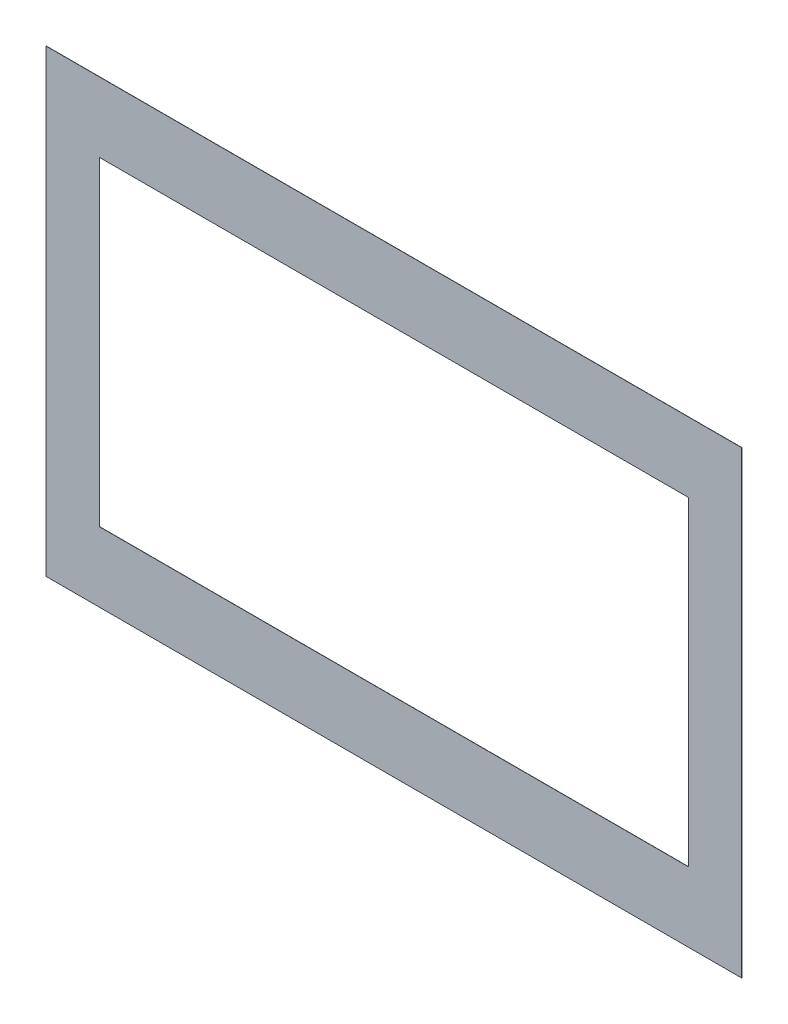
ISO-10303-21;
HEADER;
FILE_DESCRIPTION(('STEP AP214'),'2;1');
FILE_NAME('part.step','',(''),(''),'','','');
FILE_SCHEMA(('AUTOMOTIVE_DESIGN { 1 0 10303 214 1 1 1 1 }'));
ENDSEC;
DATA;
#1=APPLICATION_CONTEXT('core data for automotive mechanical design processes');
#2=APPLICATION_PROTOCOL_DEFINITION('international standard','automotive_design',2000,#1);
#3=PRODUCT_CONTEXT('',#1,'mechanical');
#4=PRODUCT('Part','Part','',(#3));
#5=PRODUCT_RELATED_PRODUCT_CATEGORY('part','',(#4));
#6=PRODUCT_DEFINITION_FORMATION('','',#4);
#7=PRODUCT_DEFINITION_CONTEXT('part definition',#1,'design');
#8=PRODUCT_DEFINITION('design','',#6,#7);
#9=PRODUCT_DEFINITION_SHAPE('','',#8);
#10=(LENGTH_UNIT() NAMED_UNIT(*) SI_UNIT(.MILLI.,.METRE.));
#11=(NAMED_UNIT(*) PLANE_ANGLE_UNIT() SI_UNIT($,.RADIAN.));
#12=(NAMED_UNIT(*) SI_UNIT($,.STERADIAN.) SOLID_ANGLE_UNIT());
#13=UNCERTAINTY_MEASURE_WITH_UNIT(LENGTH_MEASURE(1.E-05),#10,'distance_accuracy_value','');
#14=(GEOMETRIC_REPRESENTATION_CONTEXT(3) GLOBAL_UNCERTAINTY_ASSIGNED_CONTEXT((#13)) GLOBAL_UNIT_ASSIGNED_CONTEXT((#10,
#11,#12)) REPRESENTATION_CONTEXT('',''));
#15=CARTESIAN_POINT('',(0.,0.,0.));
#16=DIRECTION('',(0.,0.,1.));
#17=DIRECTION('',(1.,0.,0.));
#18=AXIS2_PLACEMENT_3D('',#15,#16,#17);
#19=CARTESIAN_POINT('',(-336.55,222.25,0.1016));
#20=DIRECTION('',(1.,0.,0.));
#21=DIRECTION('',(0.,1.,0.));
#22=AXIS2_PLACEMENT_3D('',#19,#20,#21);
#23=PLANE('',#22);
#24=DIRECTION('',(0.,-1.,0.));
#25=VECTOR('',#24,1.);
#26=CARTESIAN_POINT('',(-336.55,222.25,-0.1016));
#27=LINE('',#26,#25);
#28=CARTESIAN_POINT('',(-336.55,222.25,-0.1016));
#29=VERTEX_POINT('',#28);
#30=CARTESIAN_POINT('',(-336.55,-222.25,-0.1016));
#31=VERTEX_POINT('',#30);
#32=EDGE_CURVE('E134',#29,#31,#27,.T.);
#33=ORIENTED_EDGE('',*,*,#32,.T.);
#34=DIRECTION('',(0.,0.,-1.));
#35=VECTOR('',#34,1.);
#36=CARTESIAN_POINT('',(-336.55,-222.25,0.1016));
#37=LINE('',#36,#35);
#38=CARTESIAN_POINT('',(-336.55,-222.25,0.1016));
#39=VERTEX_POINT('',#38);
#40=EDGE_CURVE('E11',#39,#31,#37,.T.);
#41=ORIENTED_EDGE('',*,*,#40,.F.);
#42=DIRECTION('',(0.,-1.,0.));
#43=VECTOR('',#42,1.);
#44=CARTESIAN_POINT('',(-336.55,222.25,0.1016));
#45=LINE('',#44,#43);
#46=CARTESIAN_POINT('',(-336.55,222.25,0.1016));
#47=VERTEX_POINT('',#46);
#48=EDGE_CURVE('E135',#47,#39,#45,.T.);
#49=ORIENTED_EDGE('',*,*,#48,.F.);
#50=DIRECTION('',(0.,0.,-1.));
#51=VECTOR('',#50,1.);
#52=CARTESIAN_POINT('',(-336.55,222.25,0.1016));
#53=LINE('',#52,#51);
#54=EDGE_CURVE('E145',#47,#29,#53,.T.);
#55=ORIENTED_EDGE('',*,*,#54,.T.);
#56=EDGE_LOOP('',(#33,#41,#49,#55));
#57=FACE_BOUND('',#56,.T.);
#58=ADVANCED_FACE('F32',(#57),#23,.F.);
#59=CARTESIAN_POINT('',(336.55,-222.25,0.1016));
#60=DIRECTION('',(0.,1.,0.));
#61=DIRECTION('',(-1.,0.,0.));
#62=AXIS2_PLACEMENT_3D('',#59,#60,#61);
#63=PLANE('',#62);
#64=DIRECTION('',(1.,0.,0.));
#65=VECTOR('',#64,1.);
#66=CARTESIAN_POINT('',(336.55,-222.25,-0.1016));
#67=LINE('',#66,#65);
#68=CARTESIAN_POINT('',(336.55,-222.25,-0.1016));
#69=VERTEX_POINT('',#68);
#70=EDGE_CURVE('E148',#31,#69,#67,.T.);
#71=ORIENTED_EDGE('',*,*,#70,.T.);
#72=DIRECTION('',(0.,0.,-1.));
#73=VECTOR('',#72,1.);
#74=CARTESIAN_POINT('',(336.55,-222.25,0.1016));
#75=LINE('',#74,#73);
#76=CARTESIAN_POINT('',(336.55,-222.25,0.1016));
#77=VERTEX_POINT('',#76);
#78=EDGE_CURVE('E39',#77,#69,#75,.T.);
#79=ORIENTED_EDGE('',*,*,#78,.F.);
#80=DIRECTION('',(1.,0.,0.));
#81=VECTOR('',#80,1.);
#82=CARTESIAN_POINT('',(336.55,-222.25,0.1016));
#83=LINE('',#82,#81);
#84=EDGE_CURVE('E138',#39,#77,#83,.T.);
#85=ORIENTED_EDGE('',*,*,#84,.F.);
#86=ORIENTED_EDGE('',*,*,#40,.T.);
#87=EDGE_LOOP('',(#71,#79,#85,#86));
#88=FACE_BOUND('',#87,.T.);
#89=ADVANCED_FACE('F176',(#88),#63,.F.);
#90=CARTESIAN_POINT('',(336.55,222.25,0.1016));
#91=DIRECTION('',(-1.,0.,0.));
#92=DIRECTION('',(0.,-1.,0.));
#93=AXIS2_PLACEMENT_3D('',#90,#91,#92);
#94=PLANE('',#93);
#95=DIRECTION('',(0.,1.,0.));
#96=VECTOR('',#95,1.);
#97=CARTESIAN_POINT('',(336.55,222.25,-0.1016));
#98=LINE('',#97,#96);
#99=CARTESIAN_POINT('',(336.55,222.25,-0.1016));
#100=VERTEX_POINT('',#99);
#101=EDGE_CURVE('E150',#69,#100,#98,.T.);
#102=ORIENTED_EDGE('',*,*,#101,.T.);
#103=DIRECTION('',(0.,0.,-1.));
#104=VECTOR('',#103,1.);
#105=CARTESIAN_POINT('',(336.55,222.25,0.1016));
#106=LINE('',#105,#104);
#107=CARTESIAN_POINT('',(336.55,222.25,0.1016));
#108=VERTEX_POINT('',#107);
#109=EDGE_CURVE('E155',#108,#100,#106,.T.);
#110=ORIENTED_EDGE('',*,*,#109,.F.);
#111=DIRECTION('',(0.,1.,0.));
#112=VECTOR('',#111,1.);
#113=CARTESIAN_POINT('',(336.55,222.25,0.1016));
#114=LINE('',#113,#112);
#115=EDGE_CURVE('E141',#77,#108,#114,.T.);
#116=ORIENTED_EDGE('',*,*,#115,.F.);
#117=ORIENTED_EDGE('',*,*,#78,.T.);
#118=EDGE_LOOP('',(#102,#110,#116,#117));
#119=FACE_BOUND('',#118,.T.);
#120=ADVANCED_FACE('F162',(#119),#94,.F.);
#121=CARTESIAN_POINT('',(336.55,222.25,0.1016));
#122=DIRECTION('',(0.,-1.,0.));
#123=DIRECTION('',(1.,0.,0.));
#124=AXIS2_PLACEMENT_3D('',#121,#122,#123);
#125=PLANE('',#124);
#126=DIRECTION('',(-1.,0.,0.));
#127=VECTOR('',#126,1.);
#128=CARTESIAN_POINT('',(336.55,222.25,-0.1016));
#129=LINE('',#128,#127);
#130=EDGE_CURVE('E139',#100,#29,#129,.T.);
#131=ORIENTED_EDGE('',*,*,#130,.T.);
#132=ORIENTED_EDGE('',*,*,#54,.F.);
#133=DIRECTION('',(-1.,0.,0.));
#134=VECTOR('',#133,1.);
#135=CARTESIAN_POINT('',(336.55,222.25,0.1016));
#136=LINE('',#135,#134);
#137=EDGE_CURVE('E143',#108,#47,#136,.T.);
#138=ORIENTED_EDGE('',*,*,#137,.F.);
#139=ORIENTED_EDGE('',*,*,#109,.T.);
#140=EDGE_LOOP('',(#131,#132,#138,#139));
#141=FACE_BOUND('',#140,.T.);
#142=ADVANCED_FACE('F169',(#141),#125,.F.);
#143=CARTESIAN_POINT('',(0.,0.,0.1016));
#144=DIRECTION('',(0.,0.,-1.));
#145=DIRECTION('',(-1.,0.,0.));
#146=AXIS2_PLACEMENT_3D('',#143,#144,#145);
#147=PLANE('',#146);
#148=DIRECTION('',(-1.,0.,0.));
#149=VECTOR('',#148,1.);
#150=CARTESIAN_POINT('',(0.,-154.7876,0.1016));
#151=LINE('',#150,#149);
#152=CARTESIAN_POINT('',(284.9626,-154.7876,0.1016));
#153=VERTEX_POINT('',#152);
#154=CARTESIAN_POINT('',(-284.9626,-154.7876,0.1016));
#155=VERTEX_POINT('',#154);
#156=EDGE_CURVE('E121',#153,#155,#151,.T.);
#157=ORIENTED_EDGE('',*,*,#156,.T.);
#158=DIRECTION('',(0.,1.,0.));
#159=VECTOR('',#158,1.);
#160=CARTESIAN_POINT('',(-284.9626,0.,0.1016));
#161=LINE('',#160,#159);
#162=CARTESIAN_POINT('',(-284.9626,154.7876,0.1016));
#163=VERTEX_POINT('',#162);
#164=EDGE_CURVE('E102',#155,#163,#161,.T.);
#165=ORIENTED_EDGE('',*,*,#164,.T.);
#166=DIRECTION('',(1.,0.,0.));
#167=VECTOR('',#166,1.);
#168=CARTESIAN_POINT('',(0.,154.7876,0.1016));
#169=LINE('',#168,#167);
#170=CARTESIAN_POINT('',(284.9626,154.7876,0.1016));
#171=VERTEX_POINT('',#170);
#172=EDGE_CURVE('E130',#163,#171,#169,.T.);
#173=ORIENTED_EDGE('',*,*,#172,.T.);
#174=DIRECTION('',(0.,-1.,0.));
#175=VECTOR('',#174,1.);
#176=CARTESIAN_POINT('',(284.9626,0.,0.1016));
#177=LINE('',#176,#175);
#178=EDGE_CURVE('E127',#171,#153,#177,.T.);
#179=ORIENTED_EDGE('',*,*,#178,.T.);
#180=EDGE_LOOP('',(#157,#165,#173,#179));
#181=FACE_BOUND('',#180,.T.);
#182=ORIENTED_EDGE('',*,*,#48,.T.);
#183=ORIENTED_EDGE('',*,*,#84,.T.);
#184=ORIENTED_EDGE('',*,*,#115,.T.);
#185=ORIENTED_EDGE('',*,*,#137,.T.);
#186=EDGE_LOOP('',(#182,#183,#184,#185));
#187=FACE_BOUND('',#186,.T.);
#188=ADVANCED_FACE('F175',(#181,#187),#147,.F.);
#189=CARTESIAN_POINT('',(0.,0.,-0.1016));
#190=DIRECTION('',(0.,0.,-1.));
#191=DIRECTION('',(-1.,0.,0.));
#192=AXIS2_PLACEMENT_3D('',#189,#190,#191);
#193=PLANE('',#192);
#194=DIRECTION('',(0.,-1.,0.));
#195=VECTOR('',#194,1.);
#196=CARTESIAN_POINT('',(-284.9626,154.7876,-0.1016));
#197=LINE('',#196,#195);
#198=CARTESIAN_POINT('',(-284.9626,154.7876,-0.1016));
#199=VERTEX_POINT('',#198);
#200=CARTESIAN_POINT('',(-284.9626,-154.7876,-0.1016));
#201=VERTEX_POINT('',#200);
#202=EDGE_CURVE('E99',#199,#201,#197,.T.);
#203=ORIENTED_EDGE('',*,*,#202,.T.);
#204=DIRECTION('',(1.,0.,0.));
#205=VECTOR('',#204,1.);
#206=CARTESIAN_POINT('',(284.9626,-154.7876,-0.1016));
#207=LINE('',#206,#205);
#208=CARTESIAN_POINT('',(284.9626,-154.7876,-0.1016));
#209=VERTEX_POINT('',#208);
#210=EDGE_CURVE('E108',#201,#209,#207,.T.);
#211=ORIENTED_EDGE('',*,*,#210,.T.);
#212=DIRECTION('',(0.,1.,0.));
#213=VECTOR('',#212,1.);
#214=CARTESIAN_POINT('',(284.9626,154.7876,-0.1016));
#215=LINE('',#214,#213);
#216=CARTESIAN_POINT('',(284.9626,154.7876,-0.1016));
#217=VERTEX_POINT('',#216);
#218=EDGE_CURVE('E54',#209,#217,#215,.T.);
#219=ORIENTED_EDGE('',*,*,#218,.T.);
#220=DIRECTION('',(-1.,0.,0.));
#221=VECTOR('',#220,1.);
#222=CARTESIAN_POINT('',(284.9626,154.7876,-0.1016));
#223=LINE('',#222,#221);
#224=EDGE_CURVE('E105',#217,#199,#223,.T.);
#225=ORIENTED_EDGE('',*,*,#224,.T.);
#226=EDGE_LOOP('',(#203,#211,#219,#225));
#227=FACE_BOUND('',#226,.T.);
#228=ORIENTED_EDGE('',*,*,#32,.F.);
#229=ORIENTED_EDGE('',*,*,#130,.F.);
#230=ORIENTED_EDGE('',*,*,#101,.F.);
#231=ORIENTED_EDGE('',*,*,#70,.F.);
#232=EDGE_LOOP('',(#228,#229,#230,#231));
#233=FACE_BOUND('',#232,.T.);
#234=ADVANCED_FACE('F112',(#227,#233),#193,.T.);
#235=CARTESIAN_POINT('',(-284.9626,154.7876,-0.1016));
#236=DIRECTION('',(-1.,0.,0.));
#237=DIRECTION('',(0.,0.,1.));
#238=AXIS2_PLACEMENT_3D('',#235,#236,#237);
#239=PLANE('',#238);
#240=DIRECTION('',(0.,0.,1.));
#241=VECTOR('',#240,1.);
#242=CARTESIAN_POINT('',(-284.9626,-154.7876,-0.1016));
#243=LINE('',#242,#241);
#244=EDGE_CURVE('E46',#201,#155,#243,.T.);
#245=ORIENTED_EDGE('',*,*,#244,.F.);
#246=ORIENTED_EDGE('',*,*,#202,.F.);
#247=DIRECTION('',(0.,0.,1.));
#248=VECTOR('',#247,1.);
#249=CARTESIAN_POINT('',(-284.9626,154.7876,-0.1016));
#250=LINE('',#249,#248);
#251=EDGE_CURVE('E119',#199,#163,#250,.T.);
#252=ORIENTED_EDGE('',*,*,#251,.T.);
#253=ORIENTED_EDGE('',*,*,#164,.F.);
#254=EDGE_LOOP('',(#245,#246,#252,#253));
#255=FACE_BOUND('',#254,.T.);
#256=ADVANCED_FACE('F96',(#255),#239,.F.);
#257=CARTESIAN_POINT('',(284.9626,154.7876,-0.1016));
#258=DIRECTION('',(0.,1.,0.));
#259=DIRECTION('',(-1.,0.,0.));
#260=AXIS2_PLACEMENT_3D('',#257,#258,#259);
#261=PLANE('',#260);
#262=ORIENTED_EDGE('',*,*,#251,.F.);
#263=ORIENTED_EDGE('',*,*,#224,.F.);
#264=DIRECTION('',(0.,0.,1.));
#265=VECTOR('',#264,1.);
#266=CARTESIAN_POINT('',(284.9626,154.7876,-0.1016));
#267=LINE('',#266,#265);
#268=EDGE_CURVE('E122',#217,#171,#267,.T.);
#269=ORIENTED_EDGE('',*,*,#268,.T.);
#270=ORIENTED_EDGE('',*,*,#172,.F.);
#271=EDGE_LOOP('',(#262,#263,#269,#270));
#272=FACE_BOUND('',#271,.T.);
#273=ADVANCED_FACE('F193',(#272),#261,.F.);
#274=CARTESIAN_POINT('',(284.9626,154.7876,-0.1016));
#275=DIRECTION('',(1.,0.,0.));
#276=DIRECTION('',(0.,1.,0.));
#277=AXIS2_PLACEMENT_3D('',#274,#275,#276);
#278=PLANE('',#277);
#279=ORIENTED_EDGE('',*,*,#268,.F.);
#280=ORIENTED_EDGE('',*,*,#218,.F.);
#281=DIRECTION('',(0.,0.,1.));
#282=VECTOR('',#281,1.);
#283=CARTESIAN_POINT('',(284.9626,-154.7876,-0.1016));
#284=LINE('',#283,#282);
#285=EDGE_CURVE('E104',#209,#153,#284,.T.);
#286=ORIENTED_EDGE('',*,*,#285,.T.);
#287=ORIENTED_EDGE('',*,*,#178,.F.);
#288=EDGE_LOOP('',(#279,#280,#286,#287));
#289=FACE_BOUND('',#288,.T.);
#290=ADVANCED_FACE('F196',(#289),#278,.F.);
#291=CARTESIAN_POINT('',(284.9626,-154.7876,-0.1016));
#292=DIRECTION('',(0.,-1.,0.));
#293=DIRECTION('',(1.,0.,0.));
#294=AXIS2_PLACEMENT_3D('',#291,#292,#293);
#295=PLANE('',#294);
#296=ORIENTED_EDGE('',*,*,#285,.F.);
#297=ORIENTED_EDGE('',*,*,#210,.F.);
#298=ORIENTED_EDGE('',*,*,#244,.T.);
#299=ORIENTED_EDGE('',*,*,#156,.F.);
#300=EDGE_LOOP('',(#296,#297,#298,#299));
#301=FACE_BOUND('',#300,.T.);
#302=ADVANCED_FACE('F109',(#301),#295,.F.);
#303=CLOSED_SHELL('',(#58,#89,#120,#142,#188,#234,#256,#273,#290,#302));
#304=MANIFOLD_SOLID_BREP('B2',#303);
#305=ADVANCED_BREP_SHAPE_REPRESENTATION('',(#18,#304),#14);
#306=SHAPE_DEFINITION_REPRESENTATION(#9,#305);
ENDSEC;
END-ISO-10303-21;
